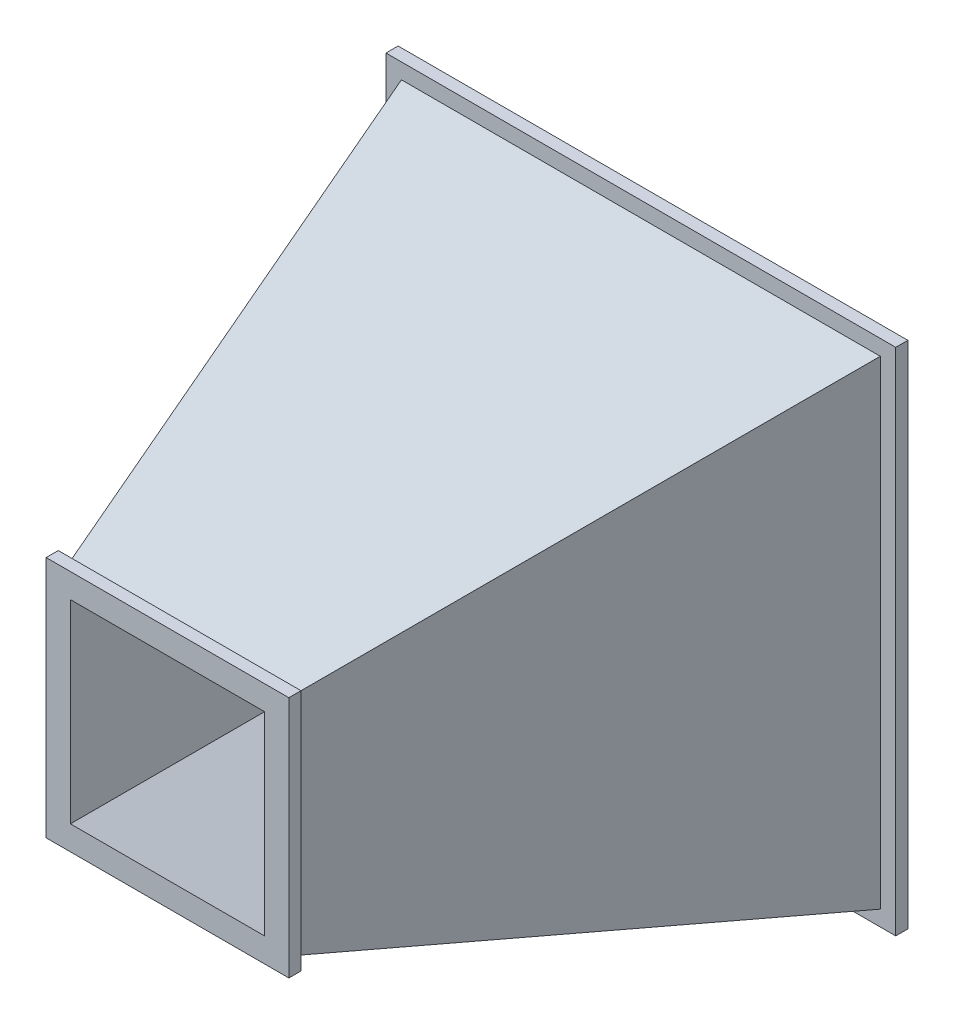
ISO-10303-21;
HEADER;
FILE_DESCRIPTION(('STEP AP214'),'2;1');
FILE_NAME('part.step','',(''),(''),'','','');
FILE_SCHEMA(('AUTOMOTIVE_DESIGN { 1 0 10303 214 1 1 1 1 }'));
ENDSEC;
DATA;
#1=APPLICATION_CONTEXT('core data for automotive mechanical design processes');
#2=APPLICATION_PROTOCOL_DEFINITION('international standard','automotive_design',2000,#1);
#3=PRODUCT_CONTEXT('',#1,'mechanical');
#4=PRODUCT('Part','Part','',(#3));
#5=PRODUCT_RELATED_PRODUCT_CATEGORY('part','',(#4));
#6=PRODUCT_DEFINITION_FORMATION('','',#4);
#7=PRODUCT_DEFINITION_CONTEXT('part definition',#1,'design');
#8=PRODUCT_DEFINITION('design','',#6,#7);
#9=PRODUCT_DEFINITION_SHAPE('','',#8);
#10=(LENGTH_UNIT() NAMED_UNIT(*) SI_UNIT(.MILLI.,.METRE.));
#11=(NAMED_UNIT(*) PLANE_ANGLE_UNIT() SI_UNIT($,.RADIAN.));
#12=(NAMED_UNIT(*) SI_UNIT($,.STERADIAN.) SOLID_ANGLE_UNIT());
#13=UNCERTAINTY_MEASURE_WITH_UNIT(LENGTH_MEASURE(1.E-05),#10,'distance_accuracy_value','');
#14=(GEOMETRIC_REPRESENTATION_CONTEXT(3) GLOBAL_UNCERTAINTY_ASSIGNED_CONTEXT((#13)) GLOBAL_UNIT_ASSIGNED_CONTEXT((#10,
#11,#12)) REPRESENTATION_CONTEXT('',''));
#15=CARTESIAN_POINT('',(0.,0.,0.));
#16=DIRECTION('',(0.,0.,1.));
#17=DIRECTION('',(1.,0.,0.));
#18=AXIS2_PLACEMENT_3D('',#15,#16,#17);
#19=CARTESIAN_POINT('',(0.,0.,0.));
#20=DIRECTION('',(0.,0.,1.));
#21=DIRECTION('',(1.,0.,0.));
#22=AXIS2_PLACEMENT_3D('',#19,#20,#21);
#23=PLANE('',#22);
#24=DIRECTION('',(1.,0.,0.));
#25=VECTOR('',#24,1.);
#26=CARTESIAN_POINT('',(-105.,105.,0.));
#27=LINE('',#26,#25);
#28=CARTESIAN_POINT('',(-105.,105.,0.));
#29=VERTEX_POINT('',#28);
#30=CARTESIAN_POINT('',(105.,105.,0.));
#31=VERTEX_POINT('',#30);
#32=EDGE_CURVE('E264',#29,#31,#27,.T.);
#33=ORIENTED_EDGE('',*,*,#32,.T.);
#34=DIRECTION('',(0.,-1.,0.));
#35=VECTOR('',#34,1.);
#36=CARTESIAN_POINT('',(105.,105.,0.));
#37=LINE('',#36,#35);
#38=CARTESIAN_POINT('',(105.,-105.,0.));
#39=VERTEX_POINT('',#38);
#40=EDGE_CURVE('E281',#31,#39,#37,.T.);
#41=ORIENTED_EDGE('',*,*,#40,.T.);
#42=DIRECTION('',(-1.,0.,0.));
#43=VECTOR('',#42,1.);
#44=CARTESIAN_POINT('',(105.,-105.,0.));
#45=LINE('',#44,#43);
#46=CARTESIAN_POINT('',(-105.,-105.,0.));
#47=VERTEX_POINT('',#46);
#48=EDGE_CURVE('E284',#39,#47,#45,.T.);
#49=ORIENTED_EDGE('',*,*,#48,.T.);
#50=DIRECTION('',(0.,1.,0.));
#51=VECTOR('',#50,1.);
#52=CARTESIAN_POINT('',(-105.,-105.,0.));
#53=LINE('',#52,#51);
#54=EDGE_CURVE('E269',#47,#29,#53,.T.);
#55=ORIENTED_EDGE('',*,*,#54,.T.);
#56=EDGE_LOOP('',(#33,#41,#49,#55));
#57=FACE_BOUND('',#56,.T.);
#58=DIRECTION('',(1.,0.,0.));
#59=VECTOR('',#58,1.);
#60=CARTESIAN_POINT('',(-95.,95.,0.));
#61=LINE('',#60,#59);
#62=CARTESIAN_POINT('',(-95.,95.,0.));
#63=VERTEX_POINT('',#62);
#64=CARTESIAN_POINT('',(94.9999999999999,95.,0.));
#65=VERTEX_POINT('',#64);
#66=EDGE_CURVE('E207',#63,#65,#61,.T.);
#67=ORIENTED_EDGE('',*,*,#66,.F.);
#68=DIRECTION('',(0.,1.,0.));
#69=VECTOR('',#68,1.);
#70=CARTESIAN_POINT('',(-95.,-95.,0.));
#71=LINE('',#70,#69);
#72=CARTESIAN_POINT('',(-95.,-95.,0.));
#73=VERTEX_POINT('',#72);
#74=EDGE_CURVE('E175',#73,#63,#71,.T.);
#75=ORIENTED_EDGE('',*,*,#74,.F.);
#76=DIRECTION('',(-1.,0.,0.));
#77=VECTOR('',#76,1.);
#78=CARTESIAN_POINT('',(95.,-95.,0.));
#79=LINE('',#78,#77);
#80=CARTESIAN_POINT('',(95.,-95.,0.));
#81=VERTEX_POINT('',#80);
#82=EDGE_CURVE('E202',#81,#73,#79,.T.);
#83=ORIENTED_EDGE('',*,*,#82,.F.);
#84=DIRECTION('',(0.,-1.,0.));
#85=VECTOR('',#84,1.);
#86=CARTESIAN_POINT('',(95.,95.,0.));
#87=LINE('',#86,#85);
#88=EDGE_CURVE('E70',#65,#81,#87,.T.);
#89=ORIENTED_EDGE('',*,*,#88,.F.);
#90=EDGE_LOOP('',(#67,#75,#83,#89));
#91=FACE_BOUND('',#90,.T.);
#92=ADVANCED_FACE('F54',(#57,#91),#23,.F.);
#93=CARTESIAN_POINT('',(0.,0.,200.));
#94=DIRECTION('',(0.,0.,1.));
#95=DIRECTION('',(1.,0.,0.));
#96=AXIS2_PLACEMENT_3D('',#93,#94,#95);
#97=PLANE('',#96);
#98=DIRECTION('',(0.,1.,0.));
#99=VECTOR('',#98,1.);
#100=CARTESIAN_POINT('',(50.,-50.,200.));
#101=LINE('',#100,#99);
#102=CARTESIAN_POINT('',(50.,-50.,200.));
#103=VERTEX_POINT('',#102);
#104=CARTESIAN_POINT('',(50.,50.,200.));
#105=VERTEX_POINT('',#104);
#106=EDGE_CURVE('E211',#103,#105,#101,.T.);
#107=ORIENTED_EDGE('',*,*,#106,.T.);
#108=DIRECTION('',(-1.,0.,0.));
#109=VECTOR('',#108,1.);
#110=CARTESIAN_POINT('',(50.,50.,200.));
#111=LINE('',#110,#109);
#112=CARTESIAN_POINT('',(-50.,50.,200.));
#113=VERTEX_POINT('',#112);
#114=EDGE_CURVE('E240',#105,#113,#111,.T.);
#115=ORIENTED_EDGE('',*,*,#114,.T.);
#116=DIRECTION('',(0.,-1.,0.));
#117=VECTOR('',#116,1.);
#118=CARTESIAN_POINT('',(-50.,50.,200.));
#119=LINE('',#118,#117);
#120=CARTESIAN_POINT('',(-50.,-50.,200.));
#121=VERTEX_POINT('',#120);
#122=EDGE_CURVE('E243',#113,#121,#119,.T.);
#123=ORIENTED_EDGE('',*,*,#122,.T.);
#124=DIRECTION('',(1.,0.,0.));
#125=VECTOR('',#124,1.);
#126=CARTESIAN_POINT('',(-50.,-50.,200.));
#127=LINE('',#126,#125);
#128=EDGE_CURVE('E228',#121,#103,#127,.T.);
#129=ORIENTED_EDGE('',*,*,#128,.T.);
#130=EDGE_LOOP('',(#107,#115,#123,#129));
#131=FACE_BOUND('',#130,.T.);
#132=DIRECTION('',(0.,-1.,0.));
#133=VECTOR('',#132,1.);
#134=CARTESIAN_POINT('',(-40.,40.,200.));
#135=LINE('',#134,#133);
#136=CARTESIAN_POINT('',(-40.,40.,200.));
#137=VERTEX_POINT('',#136);
#138=CARTESIAN_POINT('',(-40.,-40.,200.));
#139=VERTEX_POINT('',#138);
#140=EDGE_CURVE('E172',#137,#139,#135,.T.);
#141=ORIENTED_EDGE('',*,*,#140,.F.);
#142=DIRECTION('',(-1.,0.,0.));
#143=VECTOR('',#142,1.);
#144=CARTESIAN_POINT('',(40.,40.,200.));
#145=LINE('',#144,#143);
#146=CARTESIAN_POINT('',(40.,40.,200.));
#147=VERTEX_POINT('',#146);
#148=EDGE_CURVE('E183',#147,#137,#145,.T.);
#149=ORIENTED_EDGE('',*,*,#148,.F.);
#150=DIRECTION('',(0.,1.,0.));
#151=VECTOR('',#150,1.);
#152=CARTESIAN_POINT('',(40.,-40.,200.));
#153=LINE('',#152,#151);
#154=CARTESIAN_POINT('',(40.,-40.,200.));
#155=VERTEX_POINT('',#154);
#156=EDGE_CURVE('E188',#155,#147,#153,.T.);
#157=ORIENTED_EDGE('',*,*,#156,.F.);
#158=DIRECTION('',(1.,0.,0.));
#159=VECTOR('',#158,1.);
#160=CARTESIAN_POINT('',(-40.,-40.,200.));
#161=LINE('',#160,#159);
#162=EDGE_CURVE('E191',#139,#155,#161,.T.);
#163=ORIENTED_EDGE('',*,*,#162,.F.);
#164=EDGE_LOOP('',(#141,#149,#157,#163));
#165=FACE_BOUND('',#164,.T.);
#166=ADVANCED_FACE('F190',(#131,#165),#97,.T.);
#167=CARTESIAN_POINT('',(92.9692039511911,0.,25.5665310865776));
#168=DIRECTION('',(0.96420539280379,0.,0.265156483021042));
#169=DIRECTION('',(0.265156483021042,0.,-0.96420539280379));
#170=AXIS2_PLACEMENT_3D('',#167,#168,#169);
#171=PLANE('',#170);
#172=DIRECTION('',(0.256299566854098,0.256299566854098,-0.931998424923993));
#173=VECTOR('',#172,1.);
#174=CARTESIAN_POINT('',(45.,45.,200.));
#175=LINE('',#174,#173);
#176=CARTESIAN_POINT('',(46.375,46.375,195.));
#177=VERTEX_POINT('',#176);
#178=CARTESIAN_POINT('',(98.625,98.625,5.));
#179=VERTEX_POINT('',#178);
#180=EDGE_CURVE('E311',#177,#179,#175,.T.);
#181=ORIENTED_EDGE('',*,*,#180,.F.);
#182=DIRECTION('',(0.,-1.,0.));
#183=VECTOR('',#182,1.);
#184=CARTESIAN_POINT('',(46.375,0.,195.));
#185=LINE('',#184,#183);
#186=CARTESIAN_POINT('',(46.375,-46.375,195.));
#187=VERTEX_POINT('',#186);
#188=EDGE_CURVE('E261',#177,#187,#185,.T.);
#189=ORIENTED_EDGE('',*,*,#188,.T.);
#190=DIRECTION('',(0.256299566854098,-0.256299566854098,-0.931998424923993));
#191=VECTOR('',#190,1.);
#192=CARTESIAN_POINT('',(45.,-45.,200.));
#193=LINE('',#192,#191);
#194=CARTESIAN_POINT('',(98.625,-98.625,4.99999999999998));
#195=VERTEX_POINT('',#194);
#196=EDGE_CURVE('E305',#187,#195,#193,.T.);
#197=ORIENTED_EDGE('',*,*,#196,.T.);
#198=DIRECTION('',(0.,1.,0.));
#199=VECTOR('',#198,1.);
#200=CARTESIAN_POINT('',(98.625,0.,5.));
#201=LINE('',#200,#199);
#202=EDGE_CURVE('E302',#195,#179,#201,.T.);
#203=ORIENTED_EDGE('',*,*,#202,.T.);
#204=EDGE_LOOP('',(#181,#189,#197,#203));
#205=FACE_BOUND('',#204,.T.);
#206=ADVANCED_FACE('F332',(#205),#171,.T.);
#207=CARTESIAN_POINT('',(0.,92.9692039511912,25.5665310865776));
#208=DIRECTION('',(0.,0.96420539280379,0.265156483021042));
#209=DIRECTION('',(0.,-0.265156483021042,0.96420539280379));
#210=AXIS2_PLACEMENT_3D('',#207,#208,#209);
#211=PLANE('',#210);
#212=DIRECTION('',(-0.256299566854098,0.256299566854098,-0.931998424923993));
#213=VECTOR('',#212,1.);
#214=CARTESIAN_POINT('',(-45.,45.,200.));
#215=LINE('',#214,#213);
#216=CARTESIAN_POINT('',(-46.375,46.375,195.));
#217=VERTEX_POINT('',#216);
#218=CARTESIAN_POINT('',(-98.625,98.625,4.99999999999999));
#219=VERTEX_POINT('',#218);
#220=EDGE_CURVE('E395',#217,#219,#215,.T.);
#221=ORIENTED_EDGE('',*,*,#220,.F.);
#222=DIRECTION('',(1.,0.,0.));
#223=VECTOR('',#222,1.);
#224=CARTESIAN_POINT('',(0.,46.375,195.));
#225=LINE('',#224,#223);
#226=EDGE_CURVE('E258',#217,#177,#225,.T.);
#227=ORIENTED_EDGE('',*,*,#226,.T.);
#228=ORIENTED_EDGE('',*,*,#180,.T.);
#229=DIRECTION('',(-1.,0.,0.));
#230=VECTOR('',#229,1.);
#231=CARTESIAN_POINT('',(0.,98.625,5.));
#232=LINE('',#231,#230);
#233=EDGE_CURVE('E299',#179,#219,#232,.T.);
#234=ORIENTED_EDGE('',*,*,#233,.T.);
#235=EDGE_LOOP('',(#221,#227,#228,#234));
#236=FACE_BOUND('',#235,.T.);
#237=ADVANCED_FACE('F378',(#236),#211,.T.);
#238=CARTESIAN_POINT('',(0.,-92.9692039511912,25.5665310865776));
#239=DIRECTION('',(0.,-0.96420539280379,0.265156483021042));
#240=DIRECTION('',(0.,-0.265156483021042,-0.96420539280379));
#241=AXIS2_PLACEMENT_3D('',#238,#239,#240);
#242=PLANE('',#241);
#243=ORIENTED_EDGE('',*,*,#196,.F.);
#244=DIRECTION('',(-1.,0.,0.));
#245=VECTOR('',#244,1.);
#246=CARTESIAN_POINT('',(0.,-46.375,195.));
#247=LINE('',#246,#245);
#248=CARTESIAN_POINT('',(-46.375,-46.375,195.));
#249=VERTEX_POINT('',#248);
#250=EDGE_CURVE('E250',#187,#249,#247,.T.);
#251=ORIENTED_EDGE('',*,*,#250,.T.);
#252=DIRECTION('',(-0.256299566854098,-0.256299566854098,-0.931998424923993));
#253=VECTOR('',#252,1.);
#254=CARTESIAN_POINT('',(-45.,-45.,200.));
#255=LINE('',#254,#253);
#256=CARTESIAN_POINT('',(-98.625,-98.625,5.));
#257=VERTEX_POINT('',#256);
#258=EDGE_CURVE('E314',#249,#257,#255,.T.);
#259=ORIENTED_EDGE('',*,*,#258,.T.);
#260=DIRECTION('',(1.,0.,0.));
#261=VECTOR('',#260,1.);
#262=CARTESIAN_POINT('',(0.,-98.625,5.));
#263=LINE('',#262,#261);
#264=EDGE_CURVE('E291',#257,#195,#263,.T.);
#265=ORIENTED_EDGE('',*,*,#264,.T.);
#266=EDGE_LOOP('',(#243,#251,#259,#265));
#267=FACE_BOUND('',#266,.T.);
#268=ADVANCED_FACE('F382',(#267),#242,.T.);
#269=CARTESIAN_POINT('',(-92.9692039511912,0.,25.5665310865776));
#270=DIRECTION('',(-0.96420539280379,0.,0.265156483021042));
#271=DIRECTION('',(0.265156483021042,0.,0.96420539280379));
#272=AXIS2_PLACEMENT_3D('',#269,#270,#271);
#273=PLANE('',#272);
#274=ORIENTED_EDGE('',*,*,#258,.F.);
#275=DIRECTION('',(0.,1.,0.));
#276=VECTOR('',#275,1.);
#277=CARTESIAN_POINT('',(-46.375,0.,195.));
#278=LINE('',#277,#276);
#279=EDGE_CURVE('E12',#249,#217,#278,.T.);
#280=ORIENTED_EDGE('',*,*,#279,.T.);
#281=ORIENTED_EDGE('',*,*,#220,.T.);
#282=DIRECTION('',(0.,-1.,0.));
#283=VECTOR('',#282,1.);
#284=CARTESIAN_POINT('',(-98.625,0.,5.));
#285=LINE('',#284,#283);
#286=EDGE_CURVE('E62',#219,#257,#285,.T.);
#287=ORIENTED_EDGE('',*,*,#286,.T.);
#288=EDGE_LOOP('',(#274,#280,#281,#287));
#289=FACE_BOUND('',#288,.T.);
#290=ADVANCED_FACE('F374',(#289),#273,.T.);
#291=CARTESIAN_POINT('',(-105.,105.,5.));
#292=DIRECTION('',(0.,1.,0.));
#293=DIRECTION('',(0.,0.,1.));
#294=AXIS2_PLACEMENT_3D('',#291,#292,#293);
#295=PLANE('',#294);
#296=ORIENTED_EDGE('',*,*,#32,.F.);
#297=DIRECTION('',(0.,0.,-1.));
#298=VECTOR('',#297,1.);
#299=CARTESIAN_POINT('',(-105.,105.,5.));
#300=LINE('',#299,#298);
#301=CARTESIAN_POINT('',(-105.,105.,5.));
#302=VERTEX_POINT('',#301);
#303=EDGE_CURVE('E289',#302,#29,#300,.T.);
#304=ORIENTED_EDGE('',*,*,#303,.F.);
#305=DIRECTION('',(1.,0.,0.));
#306=VECTOR('',#305,1.);
#307=CARTESIAN_POINT('',(-105.,105.,5.));
#308=LINE('',#307,#306);
#309=CARTESIAN_POINT('',(105.,105.,5.));
#310=VERTEX_POINT('',#309);
#311=EDGE_CURVE('E265',#302,#310,#308,.T.);
#312=ORIENTED_EDGE('',*,*,#311,.T.);
#313=DIRECTION('',(0.,0.,-1.));
#314=VECTOR('',#313,1.);
#315=CARTESIAN_POINT('',(105.,105.,5.));
#316=LINE('',#315,#314);
#317=EDGE_CURVE('E278',#310,#31,#316,.T.);
#318=ORIENTED_EDGE('',*,*,#317,.T.);
#319=EDGE_LOOP('',(#296,#304,#312,#318));
#320=FACE_BOUND('',#319,.T.);
#321=ADVANCED_FACE('F340',(#320),#295,.T.);
#322=CARTESIAN_POINT('',(-105.,-105.,5.));
#323=DIRECTION('',(-1.,0.,0.));
#324=DIRECTION('',(0.,-1.,0.));
#325=AXIS2_PLACEMENT_3D('',#322,#323,#324);
#326=PLANE('',#325);
#327=ORIENTED_EDGE('',*,*,#54,.F.);
#328=DIRECTION('',(0.,0.,-1.));
#329=VECTOR('',#328,1.);
#330=CARTESIAN_POINT('',(-105.,-105.,5.));
#331=LINE('',#330,#329);
#332=CARTESIAN_POINT('',(-105.,-105.,5.));
#333=VERTEX_POINT('',#332);
#334=EDGE_CURVE('E292',#333,#47,#331,.T.);
#335=ORIENTED_EDGE('',*,*,#334,.F.);
#336=DIRECTION('',(0.,1.,0.));
#337=VECTOR('',#336,1.);
#338=CARTESIAN_POINT('',(-105.,-105.,5.));
#339=LINE('',#338,#337);
#340=EDGE_CURVE('E275',#333,#302,#339,.T.);
#341=ORIENTED_EDGE('',*,*,#340,.T.);
#342=ORIENTED_EDGE('',*,*,#303,.T.);
#343=EDGE_LOOP('',(#327,#335,#341,#342));
#344=FACE_BOUND('',#343,.T.);
#345=ADVANCED_FACE('F350',(#344),#326,.T.);
#346=CARTESIAN_POINT('',(105.,-105.,5.));
#347=DIRECTION('',(0.,-1.,0.));
#348=DIRECTION('',(1.,0.,0.));
#349=AXIS2_PLACEMENT_3D('',#346,#347,#348);
#350=PLANE('',#349);
#351=ORIENTED_EDGE('',*,*,#48,.F.);
#352=DIRECTION('',(0.,0.,-1.));
#353=VECTOR('',#352,1.);
#354=CARTESIAN_POINT('',(105.,-105.,5.));
#355=LINE('',#354,#353);
#356=CARTESIAN_POINT('',(105.,-105.,5.));
#357=VERTEX_POINT('',#356);
#358=EDGE_CURVE('E294',#357,#39,#355,.T.);
#359=ORIENTED_EDGE('',*,*,#358,.F.);
#360=DIRECTION('',(-1.,0.,0.));
#361=VECTOR('',#360,1.);
#362=CARTESIAN_POINT('',(105.,-105.,5.));
#363=LINE('',#362,#361);
#364=EDGE_CURVE('E272',#357,#333,#363,.T.);
#365=ORIENTED_EDGE('',*,*,#364,.T.);
#366=ORIENTED_EDGE('',*,*,#334,.T.);
#367=EDGE_LOOP('',(#351,#359,#365,#366));
#368=FACE_BOUND('',#367,.T.);
#369=ADVANCED_FACE('F348',(#368),#350,.T.);
#370=CARTESIAN_POINT('',(105.,105.,5.));
#371=DIRECTION('',(1.,0.,0.));
#372=DIRECTION('',(0.,1.,0.));
#373=AXIS2_PLACEMENT_3D('',#370,#371,#372);
#374=PLANE('',#373);
#375=ORIENTED_EDGE('',*,*,#40,.F.);
#376=ORIENTED_EDGE('',*,*,#317,.F.);
#377=DIRECTION('',(0.,-1.,0.));
#378=VECTOR('',#377,1.);
#379=CARTESIAN_POINT('',(105.,105.,5.));
#380=LINE('',#379,#378);
#381=EDGE_CURVE('E268',#310,#357,#380,.T.);
#382=ORIENTED_EDGE('',*,*,#381,.T.);
#383=ORIENTED_EDGE('',*,*,#358,.T.);
#384=EDGE_LOOP('',(#375,#376,#382,#383));
#385=FACE_BOUND('',#384,.T.);
#386=ADVANCED_FACE('F344',(#385),#374,.T.);
#387=CARTESIAN_POINT('',(0.,0.,5.));
#388=DIRECTION('',(0.,0.,-1.));
#389=DIRECTION('',(-1.,0.,0.));
#390=AXIS2_PLACEMENT_3D('',#387,#388,#389);
#391=PLANE('',#390);
#392=ORIENTED_EDGE('',*,*,#202,.F.);
#393=ORIENTED_EDGE('',*,*,#264,.F.);
#394=ORIENTED_EDGE('',*,*,#286,.F.);
#395=ORIENTED_EDGE('',*,*,#233,.F.);
#396=EDGE_LOOP('',(#392,#393,#394,#395));
#397=FACE_BOUND('',#396,.T.);
#398=ORIENTED_EDGE('',*,*,#311,.F.);
#399=ORIENTED_EDGE('',*,*,#340,.F.);
#400=ORIENTED_EDGE('',*,*,#364,.F.);
#401=ORIENTED_EDGE('',*,*,#381,.F.);
#402=EDGE_LOOP('',(#398,#399,#400,#401));
#403=FACE_BOUND('',#402,.T.);
#404=ADVANCED_FACE('F353',(#397,#403),#391,.F.);
#405=CARTESIAN_POINT('',(50.,-50.,195.));
#406=DIRECTION('',(1.,0.,0.));
#407=DIRECTION('',(0.,1.,0.));
#408=AXIS2_PLACEMENT_3D('',#405,#406,#407);
#409=PLANE('',#408);
#410=ORIENTED_EDGE('',*,*,#106,.F.);
#411=DIRECTION('',(0.,0.,1.));
#412=VECTOR('',#411,1.);
#413=CARTESIAN_POINT('',(50.,-50.,195.));
#414=LINE('',#413,#412);
#415=CARTESIAN_POINT('',(50.,-50.,195.));
#416=VERTEX_POINT('',#415);
#417=EDGE_CURVE('E248',#416,#103,#414,.T.);
#418=ORIENTED_EDGE('',*,*,#417,.F.);
#419=DIRECTION('',(0.,1.,0.));
#420=VECTOR('',#419,1.);
#421=CARTESIAN_POINT('',(50.,-50.,195.));
#422=LINE('',#421,#420);
#423=CARTESIAN_POINT('',(50.,50.,195.));
#424=VERTEX_POINT('',#423);
#425=EDGE_CURVE('E224',#416,#424,#422,.T.);
#426=ORIENTED_EDGE('',*,*,#425,.T.);
#427=DIRECTION('',(0.,0.,1.));
#428=VECTOR('',#427,1.);
#429=CARTESIAN_POINT('',(50.,50.,195.));
#430=LINE('',#429,#428);
#431=EDGE_CURVE('E237',#424,#105,#430,.T.);
#432=ORIENTED_EDGE('',*,*,#431,.T.);
#433=EDGE_LOOP('',(#410,#418,#426,#432));
#434=FACE_BOUND('',#433,.T.);
#435=ADVANCED_FACE('F355',(#434),#409,.T.);
#436=CARTESIAN_POINT('',(-50.,-50.,195.));
#437=DIRECTION('',(0.,-1.,0.));
#438=DIRECTION('',(0.,0.,-1.));
#439=AXIS2_PLACEMENT_3D('',#436,#437,#438);
#440=PLANE('',#439);
#441=ORIENTED_EDGE('',*,*,#128,.F.);
#442=DIRECTION('',(0.,0.,1.));
#443=VECTOR('',#442,1.);
#444=CARTESIAN_POINT('',(-50.,-50.,195.));
#445=LINE('',#444,#443);
#446=CARTESIAN_POINT('',(-50.,-50.,195.));
#447=VERTEX_POINT('',#446);
#448=EDGE_CURVE('E251',#447,#121,#445,.T.);
#449=ORIENTED_EDGE('',*,*,#448,.F.);
#450=DIRECTION('',(1.,0.,0.));
#451=VECTOR('',#450,1.);
#452=CARTESIAN_POINT('',(-50.,-50.,195.));
#453=LINE('',#452,#451);
#454=EDGE_CURVE('E234',#447,#416,#453,.T.);
#455=ORIENTED_EDGE('',*,*,#454,.T.);
#456=ORIENTED_EDGE('',*,*,#417,.T.);
#457=EDGE_LOOP('',(#441,#449,#455,#456));
#458=FACE_BOUND('',#457,.T.);
#459=ADVANCED_FACE('F362',(#458),#440,.T.);
#460=CARTESIAN_POINT('',(-50.,50.,195.));
#461=DIRECTION('',(-1.,0.,0.));
#462=DIRECTION('',(0.,-1.,0.));
#463=AXIS2_PLACEMENT_3D('',#460,#461,#462);
#464=PLANE('',#463);
#465=ORIENTED_EDGE('',*,*,#122,.F.);
#466=DIRECTION('',(0.,0.,1.));
#467=VECTOR('',#466,1.);
#468=CARTESIAN_POINT('',(-50.,50.,195.));
#469=LINE('',#468,#467);
#470=CARTESIAN_POINT('',(-50.,50.,195.));
#471=VERTEX_POINT('',#470);
#472=EDGE_CURVE('E253',#471,#113,#469,.T.);
#473=ORIENTED_EDGE('',*,*,#472,.F.);
#474=DIRECTION('',(0.,-1.,0.));
#475=VECTOR('',#474,1.);
#476=CARTESIAN_POINT('',(-50.,50.,195.));
#477=LINE('',#476,#475);
#478=EDGE_CURVE('E231',#471,#447,#477,.T.);
#479=ORIENTED_EDGE('',*,*,#478,.T.);
#480=ORIENTED_EDGE('',*,*,#448,.T.);
#481=EDGE_LOOP('',(#465,#473,#479,#480));
#482=FACE_BOUND('',#481,.T.);
#483=ADVANCED_FACE('F419',(#482),#464,.T.);
#484=CARTESIAN_POINT('',(50.,50.,195.));
#485=DIRECTION('',(0.,1.,0.));
#486=DIRECTION('',(0.,0.,1.));
#487=AXIS2_PLACEMENT_3D('',#484,#485,#486);
#488=PLANE('',#487);
#489=ORIENTED_EDGE('',*,*,#114,.F.);
#490=ORIENTED_EDGE('',*,*,#431,.F.);
#491=DIRECTION('',(-1.,0.,0.));
#492=VECTOR('',#491,1.);
#493=CARTESIAN_POINT('',(50.,50.,195.));
#494=LINE('',#493,#492);
#495=EDGE_CURVE('E227',#424,#471,#494,.T.);
#496=ORIENTED_EDGE('',*,*,#495,.T.);
#497=ORIENTED_EDGE('',*,*,#472,.T.);
#498=EDGE_LOOP('',(#489,#490,#496,#497));
#499=FACE_BOUND('',#498,.T.);
#500=ADVANCED_FACE('F409',(#499),#488,.T.);
#501=CARTESIAN_POINT('',(0.,0.,195.));
#502=DIRECTION('',(0.,0.,1.));
#503=DIRECTION('',(1.,0.,0.));
#504=AXIS2_PLACEMENT_3D('',#501,#502,#503);
#505=PLANE('',#504);
#506=ORIENTED_EDGE('',*,*,#188,.F.);
#507=ORIENTED_EDGE('',*,*,#226,.F.);
#508=ORIENTED_EDGE('',*,*,#279,.F.);
#509=ORIENTED_EDGE('',*,*,#250,.F.);
#510=EDGE_LOOP('',(#506,#507,#508,#509));
#511=FACE_BOUND('',#510,.T.);
#512=ORIENTED_EDGE('',*,*,#425,.F.);
#513=ORIENTED_EDGE('',*,*,#454,.F.);
#514=ORIENTED_EDGE('',*,*,#478,.F.);
#515=ORIENTED_EDGE('',*,*,#495,.F.);
#516=EDGE_LOOP('',(#512,#513,#514,#515));
#517=FACE_BOUND('',#516,.T.);
#518=ADVANCED_FACE('F406',(#511,#517),#505,.F.);
#519=CARTESIAN_POINT('',(0.,88.3207437536316,24.2882045322487));
#520=DIRECTION('',(0.,-0.96420539280379,-0.265156483021042));
#521=DIRECTION('',(0.,0.265156483021042,-0.96420539280379));
#522=AXIS2_PLACEMENT_3D('',#519,#520,#521);
#523=PLANE('',#522);
#524=DIRECTION('',(0.256299566854098,0.256299566854098,-0.931998424923993));
#525=VECTOR('',#524,1.);
#526=CARTESIAN_POINT('',(40.,40.,200.));
#527=LINE('',#526,#525);
#528=EDGE_CURVE('E180',#147,#65,#527,.T.);
#529=ORIENTED_EDGE('',*,*,#528,.F.);
#530=ORIENTED_EDGE('',*,*,#148,.T.);
#531=DIRECTION('',(-0.256299566854098,0.256299566854098,-0.931998424923993));
#532=VECTOR('',#531,1.);
#533=CARTESIAN_POINT('',(-40.,40.,200.));
#534=LINE('',#533,#532);
#535=EDGE_CURVE('E168',#137,#63,#534,.T.);
#536=ORIENTED_EDGE('',*,*,#535,.T.);
#537=ORIENTED_EDGE('',*,*,#66,.T.);
#538=EDGE_LOOP('',(#529,#530,#536,#537));
#539=FACE_BOUND('',#538,.T.);
#540=ADVANCED_FACE('F184',(#539),#523,.T.);
#541=CARTESIAN_POINT('',(-88.3207437536316,0.,24.2882045322487));
#542=DIRECTION('',(0.96420539280379,0.,-0.265156483021042));
#543=DIRECTION('',(-0.265156483021042,0.,-0.96420539280379));
#544=AXIS2_PLACEMENT_3D('',#541,#542,#543);
#545=PLANE('',#544);
#546=ORIENTED_EDGE('',*,*,#535,.F.);
#547=ORIENTED_EDGE('',*,*,#140,.T.);
#548=DIRECTION('',(-0.256299566854098,-0.256299566854098,-0.931998424923993));
#549=VECTOR('',#548,1.);
#550=CARTESIAN_POINT('',(-40.,-40.,200.));
#551=LINE('',#550,#549);
#552=EDGE_CURVE('E78',#139,#73,#551,.T.);
#553=ORIENTED_EDGE('',*,*,#552,.T.);
#554=ORIENTED_EDGE('',*,*,#74,.T.);
#555=EDGE_LOOP('',(#546,#547,#553,#554));
#556=FACE_BOUND('',#555,.T.);
#557=ADVANCED_FACE('F170',(#556),#545,.T.);
#558=CARTESIAN_POINT('',(88.3207437536316,0.,24.2882045322487));
#559=DIRECTION('',(-0.96420539280379,0.,-0.265156483021042));
#560=DIRECTION('',(-0.265156483021042,0.,0.96420539280379));
#561=AXIS2_PLACEMENT_3D('',#558,#559,#560);
#562=PLANE('',#561);
#563=DIRECTION('',(0.256299566854098,-0.256299566854098,-0.931998424923993));
#564=VECTOR('',#563,1.);
#565=CARTESIAN_POINT('',(40.,-40.,200.));
#566=LINE('',#565,#564);
#567=EDGE_CURVE('E179',#155,#81,#566,.T.);
#568=ORIENTED_EDGE('',*,*,#567,.F.);
#569=ORIENTED_EDGE('',*,*,#156,.T.);
#570=ORIENTED_EDGE('',*,*,#528,.T.);
#571=ORIENTED_EDGE('',*,*,#88,.T.);
#572=EDGE_LOOP('',(#568,#569,#570,#571));
#573=FACE_BOUND('',#572,.T.);
#574=ADVANCED_FACE('F317',(#573),#562,.T.);
#575=CARTESIAN_POINT('',(0.,-88.3207437536316,24.2882045322487));
#576=DIRECTION('',(0.,0.96420539280379,-0.265156483021042));
#577=DIRECTION('',(0.,0.265156483021042,0.96420539280379));
#578=AXIS2_PLACEMENT_3D('',#575,#576,#577);
#579=PLANE('',#578);
#580=ORIENTED_EDGE('',*,*,#552,.F.);
#581=ORIENTED_EDGE('',*,*,#162,.T.);
#582=ORIENTED_EDGE('',*,*,#567,.T.);
#583=ORIENTED_EDGE('',*,*,#82,.T.);
#584=EDGE_LOOP('',(#580,#581,#582,#583));
#585=FACE_BOUND('',#584,.T.);
#586=ADVANCED_FACE('F319',(#585),#579,.T.);
#587=CLOSED_SHELL('',(#92,#166,#206,#237,#268,#290,#321,#345,#369,#386,#404,#435,#459,#483,#500,
#518,#540,#557,#574,#586));
#588=MANIFOLD_SOLID_BREP('B2',#587);
#589=ADVANCED_BREP_SHAPE_REPRESENTATION('',(#18,#588),#14);
#590=SHAPE_DEFINITION_REPRESENTATION(#9,#589);
ENDSEC;
END-ISO-10303-21;
